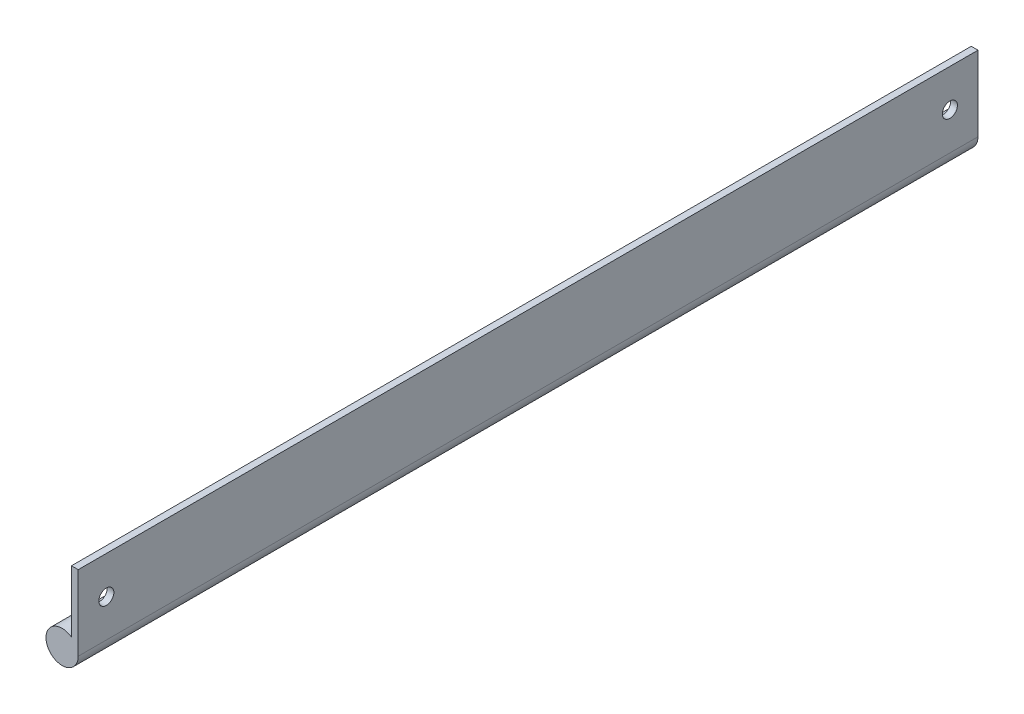
ISO-10303-21;
HEADER;
FILE_DESCRIPTION(('STEP AP214'),'2;1');
FILE_NAME('part.step','',(''),(''),'','','');
FILE_SCHEMA(('AUTOMOTIVE_DESIGN { 1 0 10303 214 1 1 1 1 }'));
ENDSEC;
DATA;
#1=APPLICATION_CONTEXT('core data for automotive mechanical design processes');
#2=APPLICATION_PROTOCOL_DEFINITION('international standard','automotive_design',2000,#1);
#3=PRODUCT_CONTEXT('',#1,'mechanical');
#4=PRODUCT('Part','Part','',(#3));
#5=PRODUCT_RELATED_PRODUCT_CATEGORY('part','',(#4));
#6=PRODUCT_DEFINITION_FORMATION('','',#4);
#7=PRODUCT_DEFINITION_CONTEXT('part definition',#1,'design');
#8=PRODUCT_DEFINITION('design','',#6,#7);
#9=PRODUCT_DEFINITION_SHAPE('','',#8);
#10=(LENGTH_UNIT() NAMED_UNIT(*) SI_UNIT(.MILLI.,.METRE.));
#11=(NAMED_UNIT(*) PLANE_ANGLE_UNIT() SI_UNIT($,.RADIAN.));
#12=(NAMED_UNIT(*) SI_UNIT($,.STERADIAN.) SOLID_ANGLE_UNIT());
#13=UNCERTAINTY_MEASURE_WITH_UNIT(LENGTH_MEASURE(1.E-05),#10,'distance_accuracy_value','');
#14=(GEOMETRIC_REPRESENTATION_CONTEXT(3) GLOBAL_UNCERTAINTY_ASSIGNED_CONTEXT((#13)) GLOBAL_UNIT_ASSIGNED_CONTEXT((#10,
#11,#12)) REPRESENTATION_CONTEXT('',''));
#15=CARTESIAN_POINT('',(0.,0.,0.));
#16=DIRECTION('',(0.,0.,1.));
#17=DIRECTION('',(1.,0.,0.));
#18=AXIS2_PLACEMENT_3D('',#15,#16,#17);
#19=CARTESIAN_POINT('',(1.143,-12.7,304.8));
#20=DIRECTION('',(-1.,0.,0.));
#21=DIRECTION('',(0.,0.,1.));
#22=AXIS2_PLACEMENT_3D('',#19,#20,#21);
#23=PLANE('',#22);
#24=CARTESIAN_POINT('',(1.143,0.,9.525));
#25=DIRECTION('',(-1.,0.,0.));
#26=DIRECTION('',(0.,0.,1.));
#27=AXIS2_PLACEMENT_3D('',#24,#25,#26);
#28=CIRCLE('',#27,2.5527);
#29=CARTESIAN_POINT('',(1.143,0.,12.0777));
#30=VERTEX_POINT('',#29);
#31=EDGE_CURVE('E114',#30,#30,#28,.T.);
#32=ORIENTED_EDGE('',*,*,#31,.T.);
#33=EDGE_LOOP('',(#32));
#34=FACE_BOUND('',#33,.T.);
#35=CARTESIAN_POINT('',(1.143,0.,295.275));
#36=DIRECTION('',(-1.,0.,0.));
#37=DIRECTION('',(0.,0.,1.));
#38=AXIS2_PLACEMENT_3D('',#35,#36,#37);
#39=CIRCLE('',#38,2.5527);
#40=CARTESIAN_POINT('',(1.143,0.,297.8277));
#41=VERTEX_POINT('',#40);
#42=EDGE_CURVE('E98',#41,#41,#39,.T.);
#43=ORIENTED_EDGE('',*,*,#42,.T.);
#44=EDGE_LOOP('',(#43));
#45=FACE_BOUND('',#44,.T.);
#46=DIRECTION('',(0.,1.,0.));
#47=VECTOR('',#46,1.);
#48=CARTESIAN_POINT('',(1.143,-12.7,0.));
#49=LINE('',#48,#47);
#50=CARTESIAN_POINT('',(1.143,-12.7,0.));
#51=VERTEX_POINT('',#50);
#52=CARTESIAN_POINT('',(1.143,12.7,0.));
#53=VERTEX_POINT('',#52);
#54=EDGE_CURVE('E95',#51,#53,#49,.T.);
#55=ORIENTED_EDGE('',*,*,#54,.T.);
#56=DIRECTION('',(0.,0.,-1.));
#57=VECTOR('',#56,1.);
#58=CARTESIAN_POINT('',(1.143,12.7,304.8));
#59=LINE('',#58,#57);
#60=CARTESIAN_POINT('',(1.143,12.7,304.8));
#61=VERTEX_POINT('',#60);
#62=EDGE_CURVE('E11',#61,#53,#59,.T.);
#63=ORIENTED_EDGE('',*,*,#62,.F.);
#64=DIRECTION('',(0.,1.,0.));
#65=VECTOR('',#64,1.);
#66=CARTESIAN_POINT('',(1.143,-12.7,304.8));
#67=LINE('',#66,#65);
#68=CARTESIAN_POINT('',(1.143,-12.7,304.8));
#69=VERTEX_POINT('',#68);
#70=EDGE_CURVE('E83',#69,#61,#67,.T.);
#71=ORIENTED_EDGE('',*,*,#70,.F.);
#72=DIRECTION('',(0.,0.,-1.));
#73=VECTOR('',#72,1.);
#74=CARTESIAN_POINT('',(1.143,-12.7,304.8));
#75=LINE('',#74,#73);
#76=EDGE_CURVE('E91',#69,#51,#75,.T.);
#77=ORIENTED_EDGE('',*,*,#76,.T.);
#78=EDGE_LOOP('',(#55,#63,#71,#77));
#79=FACE_BOUND('',#78,.T.);
#80=ADVANCED_FACE('F32',(#34,#45,#79),#23,.F.);
#81=CARTESIAN_POINT('',(-1.143,12.7,304.8));
#82=DIRECTION('',(0.,-1.,0.));
#83=DIRECTION('',(0.,0.,-1.));
#84=AXIS2_PLACEMENT_3D('',#81,#82,#83);
#85=PLANE('',#84);
#86=DIRECTION('',(-1.,0.,0.));
#87=VECTOR('',#86,1.);
#88=CARTESIAN_POINT('',(-1.143,12.7,0.));
#89=LINE('',#88,#87);
#90=CARTESIAN_POINT('',(-1.143,12.7,0.));
#91=VERTEX_POINT('',#90);
#92=EDGE_CURVE('E87',#53,#91,#89,.T.);
#93=ORIENTED_EDGE('',*,*,#92,.T.);
#94=DIRECTION('',(0.,0.,-1.));
#95=VECTOR('',#94,1.);
#96=CARTESIAN_POINT('',(-1.143,12.7,304.8));
#97=LINE('',#96,#95);
#98=CARTESIAN_POINT('',(-1.143,12.7,304.8));
#99=VERTEX_POINT('',#98);
#100=EDGE_CURVE('E40',#99,#91,#97,.T.);
#101=ORIENTED_EDGE('',*,*,#100,.F.);
#102=DIRECTION('',(-1.,0.,0.));
#103=VECTOR('',#102,1.);
#104=CARTESIAN_POINT('',(-1.143,12.7,304.8));
#105=LINE('',#104,#103);
#106=EDGE_CURVE('E78',#61,#99,#105,.T.);
#107=ORIENTED_EDGE('',*,*,#106,.F.);
#108=ORIENTED_EDGE('',*,*,#62,.T.);
#109=EDGE_LOOP('',(#93,#101,#107,#108));
#110=FACE_BOUND('',#109,.T.);
#111=ADVANCED_FACE('F86',(#110),#85,.F.);
#112=CARTESIAN_POINT('',(-1.143,-8.25681465612788,304.8));
#113=DIRECTION('',(1.,0.,0.));
#114=DIRECTION('',(0.,1.,0.));
#115=AXIS2_PLACEMENT_3D('',#112,#113,#114);
#116=PLANE('',#115);
#117=CARTESIAN_POINT('',(-1.143,0.,9.525));
#118=DIRECTION('',(-1.,0.,0.));
#119=DIRECTION('',(0.,0.,1.));
#120=AXIS2_PLACEMENT_3D('',#117,#118,#119);
#121=CIRCLE('',#120,2.5527);
#122=CARTESIAN_POINT('',(-1.143,0.,12.0777));
#123=VERTEX_POINT('',#122);
#124=EDGE_CURVE('E117',#123,#123,#121,.T.);
#125=ORIENTED_EDGE('',*,*,#124,.F.);
#126=EDGE_LOOP('',(#125));
#127=FACE_BOUND('',#126,.T.);
#128=CARTESIAN_POINT('',(-1.143,0.,295.275));
#129=DIRECTION('',(-1.,0.,0.));
#130=DIRECTION('',(0.,0.,1.));
#131=AXIS2_PLACEMENT_3D('',#128,#129,#130);
#132=CIRCLE('',#131,2.5527);
#133=CARTESIAN_POINT('',(-1.143,0.,297.8277));
#134=VERTEX_POINT('',#133);
#135=EDGE_CURVE('E111',#134,#134,#132,.T.);
#136=ORIENTED_EDGE('',*,*,#135,.F.);
#137=EDGE_LOOP('',(#136));
#138=FACE_BOUND('',#137,.T.);
#139=DIRECTION('',(0.,-1.,0.));
#140=VECTOR('',#139,1.);
#141=CARTESIAN_POINT('',(-1.143,-8.25681465612788,0.));
#142=LINE('',#141,#140);
#143=CARTESIAN_POINT('',(-1.143,-8.25681465612788,0.));
#144=VERTEX_POINT('',#143);
#145=EDGE_CURVE('E65',#91,#144,#142,.T.);
#146=ORIENTED_EDGE('',*,*,#145,.T.);
#147=DIRECTION('',(0.,0.,-1.));
#148=VECTOR('',#147,1.);
#149=CARTESIAN_POINT('',(-1.143,-8.25681465612788,304.8));
#150=LINE('',#149,#148);
#151=CARTESIAN_POINT('',(-1.143,-8.25681465612788,304.8));
#152=VERTEX_POINT('',#151);
#153=EDGE_CURVE('E88',#152,#144,#150,.T.);
#154=ORIENTED_EDGE('',*,*,#153,.F.);
#155=DIRECTION('',(0.,-1.,0.));
#156=VECTOR('',#155,1.);
#157=CARTESIAN_POINT('',(-1.143,-8.25681465612788,304.8));
#158=LINE('',#157,#156);
#159=EDGE_CURVE('E81',#99,#152,#158,.T.);
#160=ORIENTED_EDGE('',*,*,#159,.F.);
#161=ORIENTED_EDGE('',*,*,#100,.T.);
#162=EDGE_LOOP('',(#146,#154,#160,#161));
#163=FACE_BOUND('',#162,.T.);
#164=ADVANCED_FACE('F89',(#127,#138,#163),#116,.F.);
#165=CARTESIAN_POINT('',(-4.318,-12.7,304.8));
#166=DIRECTION('',(0.,0.,-1.));
#167=DIRECTION('',(-1.,0.,0.));
#168=AXIS2_PLACEMENT_3D('',#165,#166,#167);
#169=CYLINDRICAL_SURFACE('',#168,5.461);
#170=CARTESIAN_POINT('',(-4.318,-12.7,0.));
#171=DIRECTION('',(0.,0.,1.));
#172=DIRECTION('',(1.,0.,0.));
#173=AXIS2_PLACEMENT_3D('',#170,#171,#172);
#174=CIRCLE('',#173,5.461);
#175=EDGE_CURVE('E71',#144,#51,#174,.T.);
#176=ORIENTED_EDGE('',*,*,#175,.T.);
#177=ORIENTED_EDGE('',*,*,#76,.F.);
#178=CARTESIAN_POINT('',(-4.318,-12.7,304.8));
#179=DIRECTION('',(0.,0.,1.));
#180=DIRECTION('',(1.,0.,0.));
#181=AXIS2_PLACEMENT_3D('',#178,#179,#180);
#182=CIRCLE('',#181,5.461);
#183=EDGE_CURVE('E48',#152,#69,#182,.T.);
#184=ORIENTED_EDGE('',*,*,#183,.F.);
#185=ORIENTED_EDGE('',*,*,#153,.T.);
#186=EDGE_LOOP('',(#176,#177,#184,#185));
#187=FACE_BOUND('',#186,.T.);
#188=ADVANCED_FACE('F103',(#187),#169,.T.);
#189=CARTESIAN_POINT('',(-4.318,-12.7,304.8));
#190=DIRECTION('',(0.,0.,1.));
#191=DIRECTION('',(1.,0.,0.));
#192=AXIS2_PLACEMENT_3D('',#189,#190,#191);
#193=PLANE('',#192);
#194=ORIENTED_EDGE('',*,*,#70,.T.);
#195=ORIENTED_EDGE('',*,*,#106,.T.);
#196=ORIENTED_EDGE('',*,*,#159,.T.);
#197=ORIENTED_EDGE('',*,*,#183,.T.);
#198=EDGE_LOOP('',(#194,#195,#196,#197));
#199=FACE_BOUND('',#198,.T.);
#200=ADVANCED_FACE('F79',(#199),#193,.T.);
#201=CARTESIAN_POINT('',(-4.318,-12.7,0.));
#202=DIRECTION('',(0.,0.,1.));
#203=DIRECTION('',(1.,0.,0.));
#204=AXIS2_PLACEMENT_3D('',#201,#202,#203);
#205=PLANE('',#204);
#206=ORIENTED_EDGE('',*,*,#54,.F.);
#207=ORIENTED_EDGE('',*,*,#175,.F.);
#208=ORIENTED_EDGE('',*,*,#145,.F.);
#209=ORIENTED_EDGE('',*,*,#92,.F.);
#210=EDGE_LOOP('',(#206,#207,#208,#209));
#211=FACE_BOUND('',#210,.T.);
#212=ADVANCED_FACE('F106',(#211),#205,.F.);
#213=CARTESIAN_POINT('',(-1.143,0.,295.275));
#214=DIRECTION('',(-1.,0.,0.));
#215=DIRECTION('',(0.,0.,1.));
#216=AXIS2_PLACEMENT_3D('',#213,#214,#215);
#217=CYLINDRICAL_SURFACE('',#216,2.5527);
#218=ORIENTED_EDGE('',*,*,#42,.F.);
#219=EDGE_LOOP('',(#218));
#220=FACE_BOUND('',#219,.T.);
#221=ORIENTED_EDGE('',*,*,#135,.T.);
#222=EDGE_LOOP('',(#221));
#223=FACE_BOUND('',#222,.T.);
#224=ADVANCED_FACE('F128',(#220,#223),#217,.F.);
#225=CARTESIAN_POINT('',(-1.143,0.,9.525));
#226=DIRECTION('',(-1.,0.,0.));
#227=DIRECTION('',(0.,0.,1.));
#228=AXIS2_PLACEMENT_3D('',#225,#226,#227);
#229=CYLINDRICAL_SURFACE('',#228,2.5527);
#230=ORIENTED_EDGE('',*,*,#31,.F.);
#231=EDGE_LOOP('',(#230));
#232=FACE_BOUND('',#231,.T.);
#233=ORIENTED_EDGE('',*,*,#124,.T.);
#234=EDGE_LOOP('',(#233));
#235=FACE_BOUND('',#234,.T.);
#236=ADVANCED_FACE('F121',(#232,#235),#229,.F.);
#237=CLOSED_SHELL('',(#80,#111,#164,#188,#200,#212,#224,#236));
#238=MANIFOLD_SOLID_BREP('B2',#237);
#239=ADVANCED_BREP_SHAPE_REPRESENTATION('',(#18,#238),#14);
#240=SHAPE_DEFINITION_REPRESENTATION(#9,#239);
ENDSEC;
END-ISO-10303-21;
